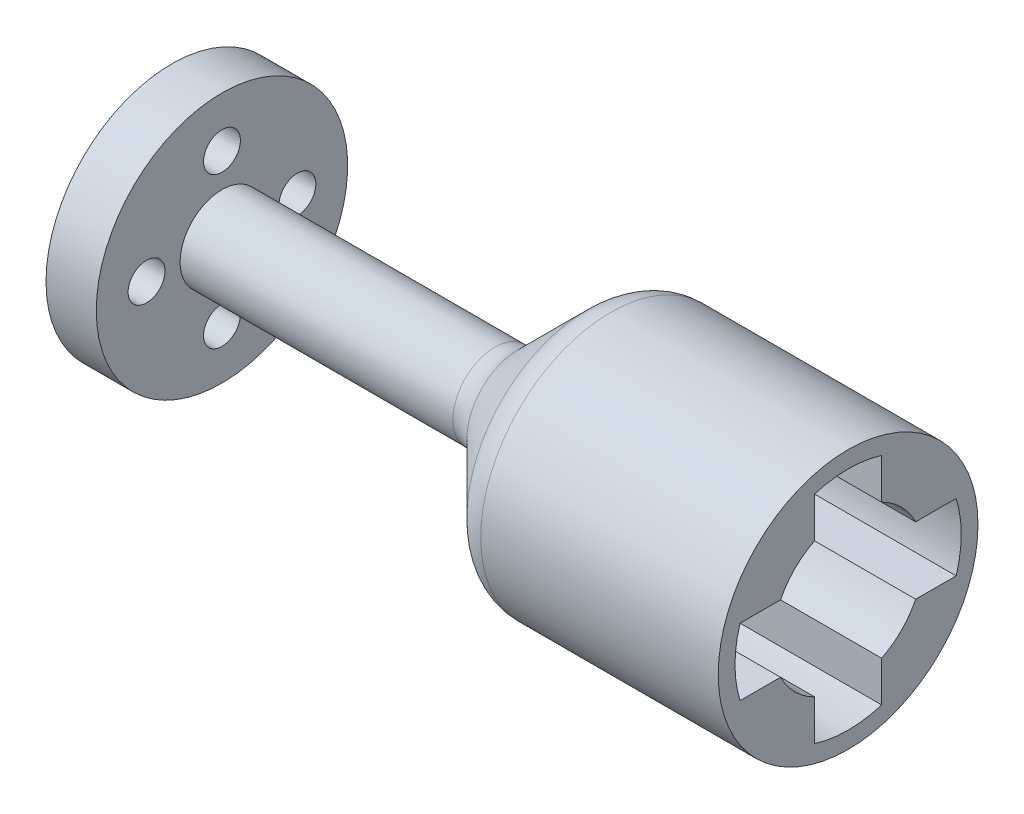
ISO-10303-21;
HEADER;
FILE_DESCRIPTION(('STEP AP214'),'2;1');
FILE_NAME('part.step','',(''),(''),'','','');
FILE_SCHEMA(('AUTOMOTIVE_DESIGN { 1 0 10303 214 1 1 1 1 }'));
ENDSEC;
DATA;
#1=APPLICATION_CONTEXT('core data for automotive mechanical design processes');
#2=APPLICATION_PROTOCOL_DEFINITION('international standard','automotive_design',2000,#1);
#3=PRODUCT_CONTEXT('',#1,'mechanical');
#4=PRODUCT('Part','Part','',(#3));
#5=PRODUCT_RELATED_PRODUCT_CATEGORY('part','',(#4));
#6=PRODUCT_DEFINITION_FORMATION('','',#4);
#7=PRODUCT_DEFINITION_CONTEXT('part definition',#1,'design');
#8=PRODUCT_DEFINITION('design','',#6,#7);
#9=PRODUCT_DEFINITION_SHAPE('','',#8);
#10=(LENGTH_UNIT() NAMED_UNIT(*) SI_UNIT(.MILLI.,.METRE.));
#11=(NAMED_UNIT(*) PLANE_ANGLE_UNIT() SI_UNIT($,.RADIAN.));
#12=(NAMED_UNIT(*) SI_UNIT($,.STERADIAN.) SOLID_ANGLE_UNIT());
#13=UNCERTAINTY_MEASURE_WITH_UNIT(LENGTH_MEASURE(1.E-05),#10,'distance_accuracy_value','');
#14=(GEOMETRIC_REPRESENTATION_CONTEXT(3) GLOBAL_UNCERTAINTY_ASSIGNED_CONTEXT((#13)) GLOBAL_UNIT_ASSIGNED_CONTEXT((#10,
#11,#12)) REPRESENTATION_CONTEXT('',''));
#15=CARTESIAN_POINT('',(0.,0.,0.));
#16=DIRECTION('',(0.,0.,1.));
#17=DIRECTION('',(1.,0.,0.));
#18=AXIS2_PLACEMENT_3D('',#15,#16,#17);
#19=CARTESIAN_POINT('',(-11.8461774132376,0.,2.));
#20=DIRECTION('',(0.,0.,1.));
#21=DIRECTION('',(1.,0.,0.));
#22=AXIS2_PLACEMENT_3D('',#19,#20,#21);
#23=PLANE('',#22);
#24=DIRECTION('',(-1.,0.,0.));
#25=VECTOR('',#24,1.);
#26=CARTESIAN_POINT('',(11.,4.03112887414927,2.));
#27=LINE('',#26,#25);
#28=CARTESIAN_POINT('',(-2.,4.03112887414927,2.));
#29=VERTEX_POINT('',#28);
#30=CARTESIAN_POINT('',(11.,4.03112887414927,2.));
#31=VERTEX_POINT('',#30);
#32=EDGE_CURVE('E317',#29,#31,#27,.F.);
#33=ORIENTED_EDGE('',*,*,#32,.F.);
#34=DIRECTION('',(0.,1.,0.));
#35=VECTOR('',#34,1.);
#36=CARTESIAN_POINT('',(-2.,0.,2.));
#37=LINE('',#36,#35);
#38=CARTESIAN_POINT('',(-2.,6.44689847911381,2.));
#39=VERTEX_POINT('',#38);
#40=EDGE_CURVE('E243',#29,#39,#37,.T.);
#41=ORIENTED_EDGE('',*,*,#40,.T.);
#42=DIRECTION('',(1.,0.,0.));
#43=VECTOR('',#42,1.);
#44=CARTESIAN_POINT('',(-11.8461774132376,6.44689847911381,2.));
#45=LINE('',#44,#43);
#46=CARTESIAN_POINT('',(11.,6.44689847911381,2.));
#47=VERTEX_POINT('',#46);
#48=EDGE_CURVE('E246',#39,#47,#45,.T.);
#49=ORIENTED_EDGE('',*,*,#48,.T.);
#50=DIRECTION('',(0.,-1.,0.));
#51=VECTOR('',#50,1.);
#52=CARTESIAN_POINT('',(11.,0.,2.));
#53=LINE('',#52,#51);
#54=EDGE_CURVE('E254',#47,#31,#53,.T.);
#55=ORIENTED_EDGE('',*,*,#54,.T.);
#56=EDGE_LOOP('',(#33,#41,#49,#55));
#57=FACE_BOUND('',#56,.T.);
#58=ADVANCED_FACE('F37',(#57),#23,.F.);
#59=CARTESIAN_POINT('',(-11.8461774132376,0.,-2.));
#60=DIRECTION('',(0.,0.,-1.));
#61=DIRECTION('',(-1.,0.,0.));
#62=AXIS2_PLACEMENT_3D('',#59,#60,#61);
#63=PLANE('',#62);
#64=DIRECTION('',(-1.,0.,0.));
#65=VECTOR('',#64,1.);
#66=CARTESIAN_POINT('',(11.,4.03112887414927,-2.));
#67=LINE('',#66,#65);
#68=CARTESIAN_POINT('',(11.,4.03112887414927,-2.));
#69=VERTEX_POINT('',#68);
#70=CARTESIAN_POINT('',(-2.,4.03112887414927,-2.));
#71=VERTEX_POINT('',#70);
#72=EDGE_CURVE('E322',#69,#71,#67,.T.);
#73=ORIENTED_EDGE('',*,*,#72,.F.);
#74=DIRECTION('',(0.,1.,0.));
#75=VECTOR('',#74,1.);
#76=CARTESIAN_POINT('',(11.,0.,-2.));
#77=LINE('',#76,#75);
#78=CARTESIAN_POINT('',(11.,6.44689847911381,-2.));
#79=VERTEX_POINT('',#78);
#80=EDGE_CURVE('E252',#69,#79,#77,.T.);
#81=ORIENTED_EDGE('',*,*,#80,.T.);
#82=DIRECTION('',(1.,0.,0.));
#83=VECTOR('',#82,1.);
#84=CARTESIAN_POINT('',(-11.8461774132376,6.44689847911381,-2.));
#85=LINE('',#84,#83);
#86=CARTESIAN_POINT('',(-2.,6.44689847911381,-2.));
#87=VERTEX_POINT('',#86);
#88=EDGE_CURVE('E244',#87,#79,#85,.T.);
#89=ORIENTED_EDGE('',*,*,#88,.F.);
#90=DIRECTION('',(0.,-1.,0.));
#91=VECTOR('',#90,1.);
#92=CARTESIAN_POINT('',(-2.,0.,-2.));
#93=LINE('',#92,#91);
#94=EDGE_CURVE('E249',#87,#71,#93,.T.);
#95=ORIENTED_EDGE('',*,*,#94,.T.);
#96=EDGE_LOOP('',(#73,#81,#89,#95));
#97=FACE_BOUND('',#96,.T.);
#98=ADVANCED_FACE('F169',(#97),#63,.F.);
#99=CARTESIAN_POINT('',(-11.8461774132376,2.,0.));
#100=DIRECTION('',(0.,1.,0.));
#101=DIRECTION('',(0.,0.,1.));
#102=AXIS2_PLACEMENT_3D('',#99,#100,#101);
#103=PLANE('',#102);
#104=DIRECTION('',(-1.,0.,0.));
#105=VECTOR('',#104,1.);
#106=CARTESIAN_POINT('',(11.,2.00000000000001,4.03112887414927));
#107=LINE('',#106,#105);
#108=CARTESIAN_POINT('',(11.,2.00000000000001,4.03112887414927));
#109=VERTEX_POINT('',#108);
#110=CARTESIAN_POINT('',(-2.,2.00000000000001,4.03112887414927));
#111=VERTEX_POINT('',#110);
#112=EDGE_CURVE('E324',#109,#111,#107,.T.);
#113=ORIENTED_EDGE('',*,*,#112,.F.);
#114=DIRECTION('',(0.,0.,1.));
#115=VECTOR('',#114,1.);
#116=CARTESIAN_POINT('',(11.,2.,0.));
#117=LINE('',#116,#115);
#118=CARTESIAN_POINT('',(11.,2.00000000000007,6.44689847911379));
#119=VERTEX_POINT('',#118);
#120=EDGE_CURVE('E276',#109,#119,#117,.T.);
#121=ORIENTED_EDGE('',*,*,#120,.T.);
#122=DIRECTION('',(1.,0.,0.));
#123=VECTOR('',#122,1.);
#124=CARTESIAN_POINT('',(-11.8461774132377,2.00000000000007,6.44689847911379));
#125=LINE('',#124,#123);
#126=CARTESIAN_POINT('',(-2.,2.00000000000007,6.44689847911379));
#127=VERTEX_POINT('',#126);
#128=EDGE_CURVE('E305',#127,#119,#125,.T.);
#129=ORIENTED_EDGE('',*,*,#128,.F.);
#130=DIRECTION('',(0.,0.,-1.));
#131=VECTOR('',#130,1.);
#132=CARTESIAN_POINT('',(-2.,2.,0.));
#133=LINE('',#132,#131);
#134=EDGE_CURVE('E257',#127,#111,#133,.T.);
#135=ORIENTED_EDGE('',*,*,#134,.T.);
#136=EDGE_LOOP('',(#113,#121,#129,#135));
#137=FACE_BOUND('',#136,.T.);
#138=ADVANCED_FACE('F175',(#137),#103,.F.);
#139=DIRECTION('',(-1.,0.,0.));
#140=VECTOR('',#139,1.);
#141=CARTESIAN_POINT('',(11.,1.99999999999999,-4.03112887414928));
#142=LINE('',#141,#140);
#143=CARTESIAN_POINT('',(-2.,1.99999999999999,-4.03112887414928));
#144=VERTEX_POINT('',#143);
#145=CARTESIAN_POINT('',(11.,1.99999999999999,-4.03112887414928));
#146=VERTEX_POINT('',#145);
#147=EDGE_CURVE('E326',#144,#146,#142,.F.);
#148=ORIENTED_EDGE('',*,*,#147,.F.);
#149=CARTESIAN_POINT('',(-2.,1.99999999999998,-6.44689847911382));
#150=VERTEX_POINT('',#149);
#151=EDGE_CURVE('E279',#144,#150,#133,.T.);
#152=ORIENTED_EDGE('',*,*,#151,.T.);
#153=DIRECTION('',(1.,0.,0.));
#154=VECTOR('',#153,1.);
#155=CARTESIAN_POINT('',(-11.8461774132376,1.99999999999998,-6.44689847911382));
#156=LINE('',#155,#154);
#157=CARTESIAN_POINT('',(11.,1.99999999999998,-6.44689847911382));
#158=VERTEX_POINT('',#157);
#159=EDGE_CURVE('E265',#150,#158,#156,.T.);
#160=ORIENTED_EDGE('',*,*,#159,.T.);
#161=EDGE_CURVE('E273',#158,#146,#117,.T.);
#162=ORIENTED_EDGE('',*,*,#161,.T.);
#163=EDGE_LOOP('',(#148,#152,#160,#162));
#164=FACE_BOUND('',#163,.T.);
#165=ADVANCED_FACE('F437',(#164),#103,.F.);
#166=CARTESIAN_POINT('',(-11.8461774132376,-2.,0.));
#167=DIRECTION('',(0.,-1.,0.));
#168=DIRECTION('',(0.,0.,-1.));
#169=AXIS2_PLACEMENT_3D('',#166,#167,#168);
#170=PLANE('',#169);
#171=DIRECTION('',(-1.,0.,0.));
#172=VECTOR('',#171,1.);
#173=CARTESIAN_POINT('',(11.,-2.00000000000001,-4.03112887414927));
#174=LINE('',#173,#172);
#175=CARTESIAN_POINT('',(11.,-2.00000000000001,-4.03112887414927));
#176=VERTEX_POINT('',#175);
#177=CARTESIAN_POINT('',(-2.,-2.00000000000001,-4.03112887414927));
#178=VERTEX_POINT('',#177);
#179=EDGE_CURVE('E328',#176,#178,#174,.T.);
#180=ORIENTED_EDGE('',*,*,#179,.F.);
#181=DIRECTION('',(0.,0.,-1.));
#182=VECTOR('',#181,1.);
#183=CARTESIAN_POINT('',(11.,-2.,0.));
#184=LINE('',#183,#182);
#185=CARTESIAN_POINT('',(11.,-2.00000000000002,-6.44689847911381));
#186=VERTEX_POINT('',#185);
#187=EDGE_CURVE('E271',#176,#186,#184,.T.);
#188=ORIENTED_EDGE('',*,*,#187,.T.);
#189=DIRECTION('',(1.,0.,0.));
#190=VECTOR('',#189,1.);
#191=CARTESIAN_POINT('',(-11.8461774132376,-2.00000000000002,-6.44689847911381));
#192=LINE('',#191,#190);
#193=CARTESIAN_POINT('',(-2.,-2.00000000000002,-6.44689847911381));
#194=VERTEX_POINT('',#193);
#195=EDGE_CURVE('E262',#194,#186,#192,.T.);
#196=ORIENTED_EDGE('',*,*,#195,.F.);
#197=DIRECTION('',(0.,0.,1.));
#198=VECTOR('',#197,1.);
#199=CARTESIAN_POINT('',(-2.,-2.,0.));
#200=LINE('',#199,#198);
#201=EDGE_CURVE('E268',#194,#178,#200,.T.);
#202=ORIENTED_EDGE('',*,*,#201,.T.);
#203=EDGE_LOOP('',(#180,#188,#196,#202));
#204=FACE_BOUND('',#203,.T.);
#205=ADVANCED_FACE('F429',(#204),#170,.F.);
#206=CARTESIAN_POINT('',(-11.8461774132376,0.,-2.));
#207=DIRECTION('',(0.,0.,-1.));
#208=DIRECTION('',(-1.,0.,0.));
#209=AXIS2_PLACEMENT_3D('',#206,#207,#208);
#210=PLANE('',#209);
#211=DIRECTION('',(-1.,0.,0.));
#212=VECTOR('',#211,1.);
#213=CARTESIAN_POINT('',(11.,-4.03112887414927,-2.));
#214=LINE('',#213,#212);
#215=CARTESIAN_POINT('',(-2.,-4.03112887414927,-2.));
#216=VERTEX_POINT('',#215);
#217=CARTESIAN_POINT('',(11.,-4.03112887414927,-2.));
#218=VERTEX_POINT('',#217);
#219=EDGE_CURVE('E330',#216,#218,#214,.F.);
#220=ORIENTED_EDGE('',*,*,#219,.F.);
#221=DIRECTION('',(0.,-1.,0.));
#222=VECTOR('',#221,1.);
#223=CARTESIAN_POINT('',(-2.,0.,-2.));
#224=LINE('',#223,#222);
#225=CARTESIAN_POINT('',(-2.,-6.44689847911381,-2.));
#226=VERTEX_POINT('',#225);
#227=EDGE_CURVE('E299',#216,#226,#224,.T.);
#228=ORIENTED_EDGE('',*,*,#227,.T.);
#229=DIRECTION('',(1.,0.,0.));
#230=VECTOR('',#229,1.);
#231=CARTESIAN_POINT('',(-11.8461774132376,-6.44689847911381,-2.));
#232=LINE('',#231,#230);
#233=CARTESIAN_POINT('',(11.,-6.44689847911381,-2.));
#234=VERTEX_POINT('',#233);
#235=EDGE_CURVE('E287',#226,#234,#232,.T.);
#236=ORIENTED_EDGE('',*,*,#235,.T.);
#237=DIRECTION('',(0.,1.,0.));
#238=VECTOR('',#237,1.);
#239=CARTESIAN_POINT('',(11.,0.,-2.));
#240=LINE('',#239,#238);
#241=EDGE_CURVE('E295',#234,#218,#240,.T.);
#242=ORIENTED_EDGE('',*,*,#241,.T.);
#243=EDGE_LOOP('',(#220,#228,#236,#242));
#244=FACE_BOUND('',#243,.T.);
#245=ADVANCED_FACE('F425',(#244),#210,.F.);
#246=CARTESIAN_POINT('',(-11.8461774132376,0.,2.));
#247=DIRECTION('',(0.,0.,1.));
#248=DIRECTION('',(1.,0.,0.));
#249=AXIS2_PLACEMENT_3D('',#246,#247,#248);
#250=PLANE('',#249);
#251=DIRECTION('',(-1.,0.,0.));
#252=VECTOR('',#251,1.);
#253=CARTESIAN_POINT('',(11.,-4.03112887414927,2.));
#254=LINE('',#253,#252);
#255=CARTESIAN_POINT('',(11.,-4.03112887414927,2.));
#256=VERTEX_POINT('',#255);
#257=CARTESIAN_POINT('',(-2.,-4.03112887414927,2.));
#258=VERTEX_POINT('',#257);
#259=EDGE_CURVE('E332',#256,#258,#254,.T.);
#260=ORIENTED_EDGE('',*,*,#259,.F.);
#261=DIRECTION('',(0.,-1.,0.));
#262=VECTOR('',#261,1.);
#263=CARTESIAN_POINT('',(11.,0.,2.));
#264=LINE('',#263,#262);
#265=CARTESIAN_POINT('',(11.,-6.44689847911381,2.));
#266=VERTEX_POINT('',#265);
#267=EDGE_CURVE('E293',#256,#266,#264,.T.);
#268=ORIENTED_EDGE('',*,*,#267,.T.);
#269=DIRECTION('',(1.,0.,0.));
#270=VECTOR('',#269,1.);
#271=CARTESIAN_POINT('',(-11.8461774132376,-6.44689847911381,2.));
#272=LINE('',#271,#270);
#273=CARTESIAN_POINT('',(-2.,-6.44689847911381,2.));
#274=VERTEX_POINT('',#273);
#275=EDGE_CURVE('E284',#274,#266,#272,.T.);
#276=ORIENTED_EDGE('',*,*,#275,.F.);
#277=DIRECTION('',(0.,1.,0.));
#278=VECTOR('',#277,1.);
#279=CARTESIAN_POINT('',(-2.,0.,2.));
#280=LINE('',#279,#278);
#281=EDGE_CURVE('E290',#274,#258,#280,.T.);
#282=ORIENTED_EDGE('',*,*,#281,.T.);
#283=EDGE_LOOP('',(#260,#268,#276,#282));
#284=FACE_BOUND('',#283,.T.);
#285=ADVANCED_FACE('F417',(#284),#250,.F.);
#286=CARTESIAN_POINT('',(-11.8461774132377,-2.,0.));
#287=DIRECTION('',(0.,-1.,0.));
#288=DIRECTION('',(0.,0.,-1.));
#289=AXIS2_PLACEMENT_3D('',#286,#287,#288);
#290=PLANE('',#289);
#291=DIRECTION('',(-1.,0.,0.));
#292=VECTOR('',#291,1.);
#293=CARTESIAN_POINT('',(11.,-1.99999999999996,4.03112887414929));
#294=LINE('',#293,#292);
#295=CARTESIAN_POINT('',(-2.,-1.99999999999996,4.0311288741493));
#296=VERTEX_POINT('',#295);
#297=CARTESIAN_POINT('',(11.,-1.99999999999996,4.0311288741493));
#298=VERTEX_POINT('',#297);
#299=EDGE_CURVE('E227',#296,#298,#294,.F.);
#300=ORIENTED_EDGE('',*,*,#299,.F.);
#301=DIRECTION('',(0.,0.,1.));
#302=VECTOR('',#301,1.);
#303=CARTESIAN_POINT('',(-2.,-2.,0.));
#304=LINE('',#303,#302);
#305=CARTESIAN_POINT('',(-2.,-1.99999999999993,6.44689847911383));
#306=VERTEX_POINT('',#305);
#307=EDGE_CURVE('E298',#296,#306,#304,.T.);
#308=ORIENTED_EDGE('',*,*,#307,.T.);
#309=DIRECTION('',(1.,0.,0.));
#310=VECTOR('',#309,1.);
#311=CARTESIAN_POINT('',(-11.8461774132377,-1.99999999999993,6.44689847911383));
#312=LINE('',#311,#310);
#313=CARTESIAN_POINT('',(11.,-1.99999999999993,6.44689847911383));
#314=VERTEX_POINT('',#313);
#315=EDGE_CURVE('E308',#306,#314,#312,.T.);
#316=ORIENTED_EDGE('',*,*,#315,.T.);
#317=DIRECTION('',(0.,0.,-1.));
#318=VECTOR('',#317,1.);
#319=CARTESIAN_POINT('',(11.,-2.,0.));
#320=LINE('',#319,#318);
#321=EDGE_CURVE('E314',#314,#298,#320,.T.);
#322=ORIENTED_EDGE('',*,*,#321,.T.);
#323=EDGE_LOOP('',(#300,#308,#316,#322));
#324=FACE_BOUND('',#323,.T.);
#325=ADVANCED_FACE('F208',(#324),#290,.F.);
#326=CARTESIAN_POINT('',(-4.,0.,0.));
#327=DIRECTION('',(1.,0.,0.));
#328=DIRECTION('',(0.,0.,-1.));
#329=AXIS2_PLACEMENT_3D('',#326,#327,#328);
#330=CONICAL_SURFACE('',#329,7.75,0.78539816339745);
#331=CARTESIAN_POINT('',(-4.58578643762691,0.,0.));
#332=DIRECTION('',(-1.,0.,0.));
#333=DIRECTION('',(0.,0.,1.));
#334=AXIS2_PLACEMENT_3D('',#331,#332,#333);
#335=CIRCLE('',#334,7.16421356237309);
#336=CARTESIAN_POINT('',(-4.58578643762691,0.,7.16421356237309));
#337=VERTEX_POINT('',#336);
#338=EDGE_CURVE('E223',#337,#337,#335,.T.);
#339=ORIENTED_EDGE('',*,*,#338,.T.);
#340=EDGE_LOOP('',(#339));
#341=FACE_BOUND('',#340,.T.);
#342=CARTESIAN_POINT('',(-8.66421356237307,0.,0.));
#343=DIRECTION('',(1.,0.,0.));
#344=DIRECTION('',(0.,0.,-1.));
#345=AXIS2_PLACEMENT_3D('',#342,#343,#344);
#346=CIRCLE('',#345,3.08578643762691);
#347=CARTESIAN_POINT('',(-8.66421356237307,0.,-3.08578643762691));
#348=VERTEX_POINT('',#347);
#349=EDGE_CURVE('E224',#348,#348,#346,.T.);
#350=ORIENTED_EDGE('',*,*,#349,.T.);
#351=EDGE_LOOP('',(#350));
#352=FACE_BOUND('',#351,.T.);
#353=ADVANCED_FACE('F205',(#341,#352),#330,.T.);
#354=CARTESIAN_POINT('',(0.,0.,0.));
#355=DIRECTION('',(-1.,0.,0.));
#356=DIRECTION('',(0.,0.,1.));
#357=AXIS2_PLACEMENT_3D('',#354,#355,#356);
#358=CYLINDRICAL_SURFACE('',#357,7.75);
#359=CARTESIAN_POINT('',(-3.17157287525381,0.,0.));
#360=DIRECTION('',(1.,0.,0.));
#361=DIRECTION('',(0.,0.,-1.));
#362=AXIS2_PLACEMENT_3D('',#359,#360,#361);
#363=CIRCLE('',#362,7.75);
#364=CARTESIAN_POINT('',(-3.17157287525381,0.,-7.75));
#365=VERTEX_POINT('',#364);
#366=EDGE_CURVE('E45',#365,#365,#363,.T.);
#367=ORIENTED_EDGE('',*,*,#366,.T.);
#368=EDGE_LOOP('',(#367));
#369=FACE_BOUND('',#368,.T.);
#370=CARTESIAN_POINT('',(11.,0.,0.));
#371=DIRECTION('',(-1.,0.,0.));
#372=DIRECTION('',(0.,0.,1.));
#373=AXIS2_PLACEMENT_3D('',#370,#371,#372);
#374=CIRCLE('',#373,7.75);
#375=CARTESIAN_POINT('',(11.,0.,7.75));
#376=VERTEX_POINT('',#375);
#377=EDGE_CURVE('E231',#376,#376,#374,.T.);
#378=ORIENTED_EDGE('',*,*,#377,.T.);
#379=EDGE_LOOP('',(#378));
#380=FACE_BOUND('',#379,.T.);
#381=ADVANCED_FACE('F201',(#369,#380),#358,.T.);
#382=CARTESIAN_POINT('',(11.,7.75,0.));
#383=DIRECTION('',(-1.,0.,0.));
#384=DIRECTION('',(0.,0.,1.));
#385=AXIS2_PLACEMENT_3D('',#382,#383,#384);
#386=PLANE('',#385);
#387=CARTESIAN_POINT('',(11.,0.,0.));
#388=DIRECTION('',(1.,0.,0.));
#389=DIRECTION('',(0.,0.,-1.));
#390=AXIS2_PLACEMENT_3D('',#387,#388,#389);
#391=CIRCLE('',#390,4.5);
#392=EDGE_CURVE('E679',#298,#256,#391,.T.);
#393=ORIENTED_EDGE('',*,*,#392,.F.);
#394=ORIENTED_EDGE('',*,*,#321,.F.);
#395=CARTESIAN_POINT('',(11.,0.,0.));
#396=DIRECTION('',(1.,0.,0.));
#397=DIRECTION('',(0.,1.,0.));
#398=AXIS2_PLACEMENT_3D('',#395,#396,#397);
#399=CIRCLE('',#398,6.75);
#400=EDGE_CURVE('E309',#119,#314,#399,.T.);
#401=ORIENTED_EDGE('',*,*,#400,.F.);
#402=ORIENTED_EDGE('',*,*,#120,.F.);
#403=EDGE_CURVE('E341',#31,#109,#391,.T.);
#404=ORIENTED_EDGE('',*,*,#403,.F.);
#405=ORIENTED_EDGE('',*,*,#54,.F.);
#406=CARTESIAN_POINT('',(11.,0.,0.));
#407=DIRECTION('',(1.,0.,0.));
#408=DIRECTION('',(0.,0.,-1.));
#409=AXIS2_PLACEMENT_3D('',#406,#407,#408);
#410=CIRCLE('',#409,6.75);
#411=EDGE_CURVE('E247',#79,#47,#410,.T.);
#412=ORIENTED_EDGE('',*,*,#411,.F.);
#413=ORIENTED_EDGE('',*,*,#80,.F.);
#414=EDGE_CURVE('E334',#146,#69,#391,.T.);
#415=ORIENTED_EDGE('',*,*,#414,.F.);
#416=ORIENTED_EDGE('',*,*,#161,.F.);
#417=CARTESIAN_POINT('',(11.,0.,0.));
#418=DIRECTION('',(1.,0.,0.));
#419=DIRECTION('',(0.,-1.,0.));
#420=AXIS2_PLACEMENT_3D('',#417,#418,#419);
#421=CIRCLE('',#420,6.75);
#422=EDGE_CURVE('E266',#186,#158,#421,.T.);
#423=ORIENTED_EDGE('',*,*,#422,.F.);
#424=ORIENTED_EDGE('',*,*,#187,.F.);
#425=EDGE_CURVE('E338',#218,#176,#391,.T.);
#426=ORIENTED_EDGE('',*,*,#425,.F.);
#427=ORIENTED_EDGE('',*,*,#241,.F.);
#428=CARTESIAN_POINT('',(11.,0.,0.));
#429=DIRECTION('',(1.,0.,0.));
#430=DIRECTION('',(0.,0.,1.));
#431=AXIS2_PLACEMENT_3D('',#428,#429,#430);
#432=CIRCLE('',#431,6.75);
#433=EDGE_CURVE('E288',#266,#234,#432,.T.);
#434=ORIENTED_EDGE('',*,*,#433,.F.);
#435=ORIENTED_EDGE('',*,*,#267,.F.);
#436=EDGE_LOOP('',(#393,#394,#401,#402,#404,#405,#412,#413,#415,#416,#423,#424,#426,#427,#434,#435));
#437=FACE_BOUND('',#436,.T.);
#438=ORIENTED_EDGE('',*,*,#377,.F.);
#439=EDGE_LOOP('',(#438));
#440=FACE_BOUND('',#439,.T.);
#441=ADVANCED_FACE('F197',(#437,#440),#386,.F.);
#442=CARTESIAN_POINT('',(-29.3598232801109,7.5,0.));
#443=DIRECTION('',(1.,0.,0.));
#444=DIRECTION('',(0.,0.,-1.));
#445=AXIS2_PLACEMENT_3D('',#442,#443,#444);
#446=PLANE('',#445);
#447=CARTESIAN_POINT('',(-29.3598232801109,0.,0.));
#448=DIRECTION('',(1.,0.,0.));
#449=DIRECTION('',(0.,0.,-1.));
#450=AXIS2_PLACEMENT_3D('',#447,#448,#449);
#451=CIRCLE('',#450,1.1);
#452=CARTESIAN_POINT('',(-29.3598232801109,0.,-1.1));
#453=VERTEX_POINT('',#452);
#454=EDGE_CURVE('E369',#453,#453,#451,.T.);
#455=ORIENTED_EDGE('',*,*,#454,.T.);
#456=EDGE_LOOP('',(#455));
#457=FACE_BOUND('',#456,.T.);
#458=CARTESIAN_POINT('',(-29.3598232801109,4.5,0.));
#459=DIRECTION('',(-1.,0.,0.));
#460=DIRECTION('',(0.,0.,1.));
#461=AXIS2_PLACEMENT_3D('',#458,#459,#460);
#462=CIRCLE('',#461,1.1);
#463=CARTESIAN_POINT('',(-29.3598232801109,4.5,1.1));
#464=VERTEX_POINT('',#463);
#465=EDGE_CURVE('E361',#464,#464,#462,.T.);
#466=ORIENTED_EDGE('',*,*,#465,.F.);
#467=EDGE_LOOP('',(#466));
#468=FACE_BOUND('',#467,.T.);
#469=CARTESIAN_POINT('',(-29.3598232801109,0.,4.5));
#470=DIRECTION('',(-1.,0.,0.));
#471=DIRECTION('',(0.,0.,1.));
#472=AXIS2_PLACEMENT_3D('',#469,#470,#471);
#473=CIRCLE('',#472,1.1);
#474=CARTESIAN_POINT('',(-29.3598232801109,0.,5.6));
#475=VERTEX_POINT('',#474);
#476=EDGE_CURVE('E355',#475,#475,#473,.T.);
#477=ORIENTED_EDGE('',*,*,#476,.F.);
#478=EDGE_LOOP('',(#477));
#479=FACE_BOUND('',#478,.T.);
#480=CARTESIAN_POINT('',(-29.3598232801109,-4.5,0.));
#481=DIRECTION('',(-1.,0.,0.));
#482=DIRECTION('',(0.,0.,1.));
#483=AXIS2_PLACEMENT_3D('',#480,#481,#482);
#484=CIRCLE('',#483,1.1);
#485=CARTESIAN_POINT('',(-29.3598232801109,-4.5,1.1));
#486=VERTEX_POINT('',#485);
#487=EDGE_CURVE('E349',#486,#486,#484,.T.);
#488=ORIENTED_EDGE('',*,*,#487,.F.);
#489=EDGE_LOOP('',(#488));
#490=FACE_BOUND('',#489,.T.);
#491=CARTESIAN_POINT('',(-29.3598232801109,0.,-4.5));
#492=DIRECTION('',(-1.,0.,0.));
#493=DIRECTION('',(0.,0.,1.));
#494=AXIS2_PLACEMENT_3D('',#491,#492,#493);
#495=CIRCLE('',#494,1.1);
#496=CARTESIAN_POINT('',(-29.3598232801109,0.,-3.4));
#497=VERTEX_POINT('',#496);
#498=EDGE_CURVE('E342',#497,#497,#495,.T.);
#499=ORIENTED_EDGE('',*,*,#498,.F.);
#500=EDGE_LOOP('',(#499));
#501=FACE_BOUND('',#500,.T.);
#502=CARTESIAN_POINT('',(-29.3598232801109,0.,0.));
#503=DIRECTION('',(-1.,0.,0.));
#504=DIRECTION('',(0.,0.,1.));
#505=AXIS2_PLACEMENT_3D('',#502,#503,#504);
#506=CIRCLE('',#505,7.5);
#507=CARTESIAN_POINT('',(-29.3598232801109,0.,7.5));
#508=VERTEX_POINT('',#507);
#509=EDGE_CURVE('E234',#508,#508,#506,.T.);
#510=ORIENTED_EDGE('',*,*,#509,.T.);
#511=EDGE_LOOP('',(#510));
#512=FACE_BOUND('',#511,.T.);
#513=ADVANCED_FACE('F193',(#457,#468,#479,#490,#501,#512),#446,.F.);
#514=CARTESIAN_POINT('',(0.,0.,0.));
#515=DIRECTION('',(-1.,0.,0.));
#516=DIRECTION('',(0.,0.,1.));
#517=AXIS2_PLACEMENT_3D('',#514,#515,#516);
#518=CYLINDRICAL_SURFACE('',#517,7.5);
#519=ORIENTED_EDGE('',*,*,#509,.F.);
#520=EDGE_LOOP('',(#519));
#521=FACE_BOUND('',#520,.T.);
#522=CARTESIAN_POINT('',(-26.3598232801109,0.,0.));
#523=DIRECTION('',(-1.,0.,0.));
#524=DIRECTION('',(0.,0.,1.));
#525=AXIS2_PLACEMENT_3D('',#522,#523,#524);
#526=CIRCLE('',#525,7.5);
#527=CARTESIAN_POINT('',(-26.3598232801109,0.,7.5));
#528=VERTEX_POINT('',#527);
#529=EDGE_CURVE('E237',#528,#528,#526,.T.);
#530=ORIENTED_EDGE('',*,*,#529,.T.);
#531=EDGE_LOOP('',(#530));
#532=FACE_BOUND('',#531,.T.);
#533=ADVANCED_FACE('F189',(#521,#532),#518,.T.);
#534=CARTESIAN_POINT('',(-26.3598232801109,7.5,0.));
#535=DIRECTION('',(-1.,0.,0.));
#536=DIRECTION('',(0.,0.,1.));
#537=AXIS2_PLACEMENT_3D('',#534,#535,#536);
#538=PLANE('',#537);
#539=CARTESIAN_POINT('',(-26.3598232801109,4.5,0.));
#540=DIRECTION('',(-1.,0.,0.));
#541=DIRECTION('',(0.,0.,1.));
#542=AXIS2_PLACEMENT_3D('',#539,#540,#541);
#543=CIRCLE('',#542,1.1);
#544=CARTESIAN_POINT('',(-26.3598232801109,4.5,1.1));
#545=VERTEX_POINT('',#544);
#546=EDGE_CURVE('E364',#545,#545,#543,.F.);
#547=ORIENTED_EDGE('',*,*,#546,.F.);
#548=EDGE_LOOP('',(#547));
#549=FACE_BOUND('',#548,.T.);
#550=CARTESIAN_POINT('',(-26.3598232801109,0.,4.5));
#551=DIRECTION('',(-1.,0.,0.));
#552=DIRECTION('',(0.,0.,1.));
#553=AXIS2_PLACEMENT_3D('',#550,#551,#552);
#554=CIRCLE('',#553,1.1);
#555=CARTESIAN_POINT('',(-26.3598232801109,0.,5.6));
#556=VERTEX_POINT('',#555);
#557=EDGE_CURVE('E358',#556,#556,#554,.F.);
#558=ORIENTED_EDGE('',*,*,#557,.F.);
#559=EDGE_LOOP('',(#558));
#560=FACE_BOUND('',#559,.T.);
#561=CARTESIAN_POINT('',(-26.3598232801109,-4.5,0.));
#562=DIRECTION('',(-1.,0.,0.));
#563=DIRECTION('',(0.,0.,1.));
#564=AXIS2_PLACEMENT_3D('',#561,#562,#563);
#565=CIRCLE('',#564,1.1);
#566=CARTESIAN_POINT('',(-26.3598232801109,-4.5,1.1));
#567=VERTEX_POINT('',#566);
#568=EDGE_CURVE('E352',#567,#567,#565,.F.);
#569=ORIENTED_EDGE('',*,*,#568,.F.);
#570=EDGE_LOOP('',(#569));
#571=FACE_BOUND('',#570,.T.);
#572=CARTESIAN_POINT('',(-26.3598232801109,0.,-4.5));
#573=DIRECTION('',(-1.,0.,0.));
#574=DIRECTION('',(0.,0.,1.));
#575=AXIS2_PLACEMENT_3D('',#572,#573,#574);
#576=CIRCLE('',#575,1.1);
#577=CARTESIAN_POINT('',(-26.3598232801109,0.,-3.4));
#578=VERTEX_POINT('',#577);
#579=EDGE_CURVE('E345',#578,#578,#576,.F.);
#580=ORIENTED_EDGE('',*,*,#579,.F.);
#581=EDGE_LOOP('',(#580));
#582=FACE_BOUND('',#581,.T.);
#583=ORIENTED_EDGE('',*,*,#529,.F.);
#584=EDGE_LOOP('',(#583));
#585=FACE_BOUND('',#584,.T.);
#586=CARTESIAN_POINT('',(-26.3598232801109,0.,0.));
#587=DIRECTION('',(-1.,0.,0.));
#588=DIRECTION('',(0.,0.,1.));
#589=AXIS2_PLACEMENT_3D('',#586,#587,#588);
#590=CIRCLE('',#589,2.5);
#591=CARTESIAN_POINT('',(-26.3598232801109,0.,2.5));
#592=VERTEX_POINT('',#591);
#593=EDGE_CURVE('E240',#592,#592,#590,.T.);
#594=ORIENTED_EDGE('',*,*,#593,.T.);
#595=EDGE_LOOP('',(#594));
#596=FACE_BOUND('',#595,.T.);
#597=ADVANCED_FACE('F185',(#549,#560,#571,#582,#585,#596),#538,.F.);
#598=CARTESIAN_POINT('',(0.,0.,0.));
#599=DIRECTION('',(-1.,0.,0.));
#600=DIRECTION('',(0.,0.,1.));
#601=AXIS2_PLACEMENT_3D('',#598,#599,#600);
#602=CYLINDRICAL_SURFACE('',#601,2.5);
#603=CARTESIAN_POINT('',(-10.0784271247462,0.,0.));
#604=DIRECTION('',(-1.,0.,0.));
#605=DIRECTION('',(0.,0.,1.));
#606=AXIS2_PLACEMENT_3D('',#603,#604,#605);
#607=CIRCLE('',#606,2.5);
#608=CARTESIAN_POINT('',(-10.0784271247462,0.,2.5));
#609=VERTEX_POINT('',#608);
#610=EDGE_CURVE('E12',#609,#609,#607,.T.);
#611=ORIENTED_EDGE('',*,*,#610,.T.);
#612=EDGE_LOOP('',(#611));
#613=FACE_BOUND('',#612,.T.);
#614=ORIENTED_EDGE('',*,*,#593,.F.);
#615=EDGE_LOOP('',(#614));
#616=FACE_BOUND('',#615,.T.);
#617=ADVANCED_FACE('F181',(#613,#616),#602,.T.);
#618=CARTESIAN_POINT('',(-11.8461774132376,0.,0.));
#619=DIRECTION('',(1.,0.,0.));
#620=DIRECTION('',(0.,0.,-1.));
#621=AXIS2_PLACEMENT_3D('',#618,#619,#620);
#622=CYLINDRICAL_SURFACE('',#621,6.75);
#623=CARTESIAN_POINT('',(-2.,0.,0.));
#624=DIRECTION('',(1.,0.,0.));
#625=DIRECTION('',(0.,0.,-1.));
#626=AXIS2_PLACEMENT_3D('',#623,#624,#625);
#627=CIRCLE('',#626,6.75);
#628=EDGE_CURVE('E61',#39,#87,#627,.F.);
#629=ORIENTED_EDGE('',*,*,#628,.T.);
#630=ORIENTED_EDGE('',*,*,#88,.T.);
#631=ORIENTED_EDGE('',*,*,#411,.T.);
#632=ORIENTED_EDGE('',*,*,#48,.F.);
#633=EDGE_LOOP('',(#629,#630,#631,#632));
#634=FACE_BOUND('',#633,.T.);
#635=ADVANCED_FACE('F184',(#634),#622,.F.);
#636=CARTESIAN_POINT('',(-2.,0.,0.));
#637=DIRECTION('',(1.,0.,0.));
#638=DIRECTION('',(0.,0.,-1.));
#639=AXIS2_PLACEMENT_3D('',#636,#637,#638);
#640=PLANE('',#639);
#641=ORIENTED_EDGE('',*,*,#40,.F.);
#642=CARTESIAN_POINT('',(-2.,0.,0.));
#643=DIRECTION('',(1.,0.,0.));
#644=DIRECTION('',(0.,0.,-1.));
#645=AXIS2_PLACEMENT_3D('',#642,#643,#644);
#646=CIRCLE('',#645,4.5);
#647=EDGE_CURVE('E52',#29,#111,#646,.T.);
#648=ORIENTED_EDGE('',*,*,#647,.T.);
#649=ORIENTED_EDGE('',*,*,#134,.F.);
#650=CARTESIAN_POINT('',(-2.,0.,0.));
#651=DIRECTION('',(1.,0.,0.));
#652=DIRECTION('',(0.,0.,-1.));
#653=AXIS2_PLACEMENT_3D('',#650,#651,#652);
#654=CIRCLE('',#653,6.75);
#655=EDGE_CURVE('E311',#306,#127,#654,.F.);
#656=ORIENTED_EDGE('',*,*,#655,.F.);
#657=ORIENTED_EDGE('',*,*,#307,.F.);
#658=EDGE_CURVE('E694',#296,#258,#646,.T.);
#659=ORIENTED_EDGE('',*,*,#658,.T.);
#660=ORIENTED_EDGE('',*,*,#281,.F.);
#661=CARTESIAN_POINT('',(-2.,0.,0.));
#662=DIRECTION('',(1.,0.,0.));
#663=DIRECTION('',(0.,0.,-1.));
#664=AXIS2_PLACEMENT_3D('',#661,#662,#663);
#665=CIRCLE('',#664,6.75);
#666=EDGE_CURVE('E301',#226,#274,#665,.F.);
#667=ORIENTED_EDGE('',*,*,#666,.F.);
#668=ORIENTED_EDGE('',*,*,#227,.F.);
#669=EDGE_CURVE('E339',#216,#178,#646,.T.);
#670=ORIENTED_EDGE('',*,*,#669,.T.);
#671=ORIENTED_EDGE('',*,*,#201,.F.);
#672=CARTESIAN_POINT('',(-2.,0.,0.));
#673=DIRECTION('',(1.,0.,0.));
#674=DIRECTION('',(0.,0.,-1.));
#675=AXIS2_PLACEMENT_3D('',#672,#673,#674);
#676=CIRCLE('',#675,6.75);
#677=EDGE_CURVE('E280',#150,#194,#676,.F.);
#678=ORIENTED_EDGE('',*,*,#677,.F.);
#679=ORIENTED_EDGE('',*,*,#151,.F.);
#680=EDGE_CURVE('E335',#144,#71,#646,.T.);
#681=ORIENTED_EDGE('',*,*,#680,.T.);
#682=ORIENTED_EDGE('',*,*,#94,.F.);
#683=ORIENTED_EDGE('',*,*,#628,.F.);
#684=EDGE_LOOP('',(#641,#648,#649,#656,#657,#659,#660,#667,#668,#670,#671,#678,#679,#681,#682,#683));
#685=FACE_BOUND('',#684,.T.);
#686=ADVANCED_FACE('F433',(#685),#640,.T.);
#687=CARTESIAN_POINT('',(-11.8461774132376,0.,0.));
#688=DIRECTION('',(1.,0.,0.));
#689=DIRECTION('',(0.,0.,-1.));
#690=AXIS2_PLACEMENT_3D('',#687,#688,#689);
#691=CYLINDRICAL_SURFACE('',#690,6.75);
#692=ORIENTED_EDGE('',*,*,#677,.T.);
#693=ORIENTED_EDGE('',*,*,#195,.T.);
#694=ORIENTED_EDGE('',*,*,#422,.T.);
#695=ORIENTED_EDGE('',*,*,#159,.F.);
#696=EDGE_LOOP('',(#692,#693,#694,#695));
#697=FACE_BOUND('',#696,.T.);
#698=ADVANCED_FACE('F421',(#697),#691,.F.);
#699=CARTESIAN_POINT('',(-11.8461774132376,0.,0.));
#700=DIRECTION('',(1.,0.,0.));
#701=DIRECTION('',(0.,0.,-1.));
#702=AXIS2_PLACEMENT_3D('',#699,#700,#701);
#703=CYLINDRICAL_SURFACE('',#702,6.75);
#704=ORIENTED_EDGE('',*,*,#666,.T.);
#705=ORIENTED_EDGE('',*,*,#275,.T.);
#706=ORIENTED_EDGE('',*,*,#433,.T.);
#707=ORIENTED_EDGE('',*,*,#235,.F.);
#708=EDGE_LOOP('',(#704,#705,#706,#707));
#709=FACE_BOUND('',#708,.T.);
#710=ADVANCED_FACE('F413',(#709),#703,.F.);
#711=CARTESIAN_POINT('',(-11.8461774132377,0.,0.));
#712=DIRECTION('',(1.,0.,0.));
#713=DIRECTION('',(0.,0.,-1.));
#714=AXIS2_PLACEMENT_3D('',#711,#712,#713);
#715=CYLINDRICAL_SURFACE('',#714,6.75);
#716=ORIENTED_EDGE('',*,*,#655,.T.);
#717=ORIENTED_EDGE('',*,*,#128,.T.);
#718=ORIENTED_EDGE('',*,*,#400,.T.);
#719=ORIENTED_EDGE('',*,*,#315,.F.);
#720=EDGE_LOOP('',(#716,#717,#718,#719));
#721=FACE_BOUND('',#720,.T.);
#722=ADVANCED_FACE('F410',(#721),#715,.F.);
#723=CARTESIAN_POINT('',(11.,0.,0.));
#724=DIRECTION('',(-1.,0.,0.));
#725=DIRECTION('',(0.,0.,1.));
#726=AXIS2_PLACEMENT_3D('',#723,#724,#725);
#727=CYLINDRICAL_SURFACE('',#726,4.5);
#728=ORIENTED_EDGE('',*,*,#259,.T.);
#729=ORIENTED_EDGE('',*,*,#658,.F.);
#730=ORIENTED_EDGE('',*,*,#299,.T.);
#731=ORIENTED_EDGE('',*,*,#392,.T.);
#732=EDGE_LOOP('',(#728,#729,#730,#731));
#733=FACE_BOUND('',#732,.T.);
#734=ADVANCED_FACE('F407',(#733),#727,.F.);
#735=ORIENTED_EDGE('',*,*,#179,.T.);
#736=ORIENTED_EDGE('',*,*,#669,.F.);
#737=ORIENTED_EDGE('',*,*,#219,.T.);
#738=ORIENTED_EDGE('',*,*,#425,.T.);
#739=EDGE_LOOP('',(#735,#736,#737,#738));
#740=FACE_BOUND('',#739,.T.);
#741=ADVANCED_FACE('F472',(#740),#727,.F.);
#742=ORIENTED_EDGE('',*,*,#72,.T.);
#743=ORIENTED_EDGE('',*,*,#680,.F.);
#744=ORIENTED_EDGE('',*,*,#147,.T.);
#745=ORIENTED_EDGE('',*,*,#414,.T.);
#746=EDGE_LOOP('',(#742,#743,#744,#745));
#747=FACE_BOUND('',#746,.T.);
#748=ADVANCED_FACE('F404',(#747),#727,.F.);
#749=ORIENTED_EDGE('',*,*,#32,.T.);
#750=ORIENTED_EDGE('',*,*,#403,.T.);
#751=ORIENTED_EDGE('',*,*,#112,.T.);
#752=ORIENTED_EDGE('',*,*,#647,.F.);
#753=EDGE_LOOP('',(#749,#750,#751,#752));
#754=FACE_BOUND('',#753,.T.);
#755=ADVANCED_FACE('F394',(#754),#727,.F.);
#756=CARTESIAN_POINT('',(11.001,0.,-4.5));
#757=DIRECTION('',(-1.,0.,0.));
#758=DIRECTION('',(0.,0.,1.));
#759=AXIS2_PLACEMENT_3D('',#756,#757,#758);
#760=CYLINDRICAL_SURFACE('',#759,1.1);
#761=ORIENTED_EDGE('',*,*,#498,.T.);
#762=EDGE_LOOP('',(#761));
#763=FACE_BOUND('',#762,.T.);
#764=ORIENTED_EDGE('',*,*,#579,.T.);
#765=EDGE_LOOP('',(#764));
#766=FACE_BOUND('',#765,.T.);
#767=ADVANCED_FACE('F390',(#763,#766),#760,.F.);
#768=CARTESIAN_POINT('',(11.001,-4.5,0.));
#769=DIRECTION('',(-1.,0.,0.));
#770=DIRECTION('',(0.,0.,1.));
#771=AXIS2_PLACEMENT_3D('',#768,#769,#770);
#772=CYLINDRICAL_SURFACE('',#771,1.1);
#773=ORIENTED_EDGE('',*,*,#487,.T.);
#774=EDGE_LOOP('',(#773));
#775=FACE_BOUND('',#774,.T.);
#776=ORIENTED_EDGE('',*,*,#568,.T.);
#777=EDGE_LOOP('',(#776));
#778=FACE_BOUND('',#777,.T.);
#779=ADVANCED_FACE('F393',(#775,#778),#772,.F.);
#780=CARTESIAN_POINT('',(11.001,0.,4.5));
#781=DIRECTION('',(-1.,0.,0.));
#782=DIRECTION('',(0.,0.,1.));
#783=AXIS2_PLACEMENT_3D('',#780,#781,#782);
#784=CYLINDRICAL_SURFACE('',#783,1.1);
#785=ORIENTED_EDGE('',*,*,#476,.T.);
#786=EDGE_LOOP('',(#785));
#787=FACE_BOUND('',#786,.T.);
#788=ORIENTED_EDGE('',*,*,#557,.T.);
#789=EDGE_LOOP('',(#788));
#790=FACE_BOUND('',#789,.T.);
#791=ADVANCED_FACE('F216',(#787,#790),#784,.F.);
#792=CARTESIAN_POINT('',(11.001,4.5,0.));
#793=DIRECTION('',(-1.,0.,0.));
#794=DIRECTION('',(0.,0.,1.));
#795=AXIS2_PLACEMENT_3D('',#792,#793,#794);
#796=CYLINDRICAL_SURFACE('',#795,1.1);
#797=ORIENTED_EDGE('',*,*,#465,.T.);
#798=EDGE_LOOP('',(#797));
#799=FACE_BOUND('',#798,.T.);
#800=ORIENTED_EDGE('',*,*,#546,.T.);
#801=EDGE_LOOP('',(#800));
#802=FACE_BOUND('',#801,.T.);
#803=ADVANCED_FACE('F211',(#799,#802),#796,.F.);
#804=CARTESIAN_POINT('',(-3.17157287525381,0.,0.));
#805=DIRECTION('',(1.,0.,0.));
#806=DIRECTION('',(0.,0.,-1.));
#807=AXIS2_PLACEMENT_3D('',#804,#805,#806);
#808=TOROIDAL_SURFACE('',#807,5.75,2.);
#809=ORIENTED_EDGE('',*,*,#366,.F.);
#810=EDGE_LOOP('',(#809));
#811=FACE_BOUND('',#810,.T.);
#812=ORIENTED_EDGE('',*,*,#338,.F.);
#813=EDGE_LOOP('',(#812));
#814=FACE_BOUND('',#813,.T.);
#815=ADVANCED_FACE('F164',(#811,#814),#808,.T.);
#816=CARTESIAN_POINT('',(-10.0784271247462,0.,0.));
#817=DIRECTION('',(-1.,0.,0.));
#818=DIRECTION('',(0.,0.,1.));
#819=AXIS2_PLACEMENT_3D('',#816,#817,#818);
#820=TOROIDAL_SURFACE('',#819,4.5,2.);
#821=ORIENTED_EDGE('',*,*,#349,.F.);
#822=EDGE_LOOP('',(#821));
#823=FACE_BOUND('',#822,.T.);
#824=ORIENTED_EDGE('',*,*,#610,.F.);
#825=EDGE_LOOP('',(#824));
#826=FACE_BOUND('',#825,.T.);
#827=ADVANCED_FACE('F39',(#823,#826),#820,.F.);
#828=CARTESIAN_POINT('',(-24.2598232801109,0.,0.));
#829=DIRECTION('',(-1.,0.,0.));
#830=DIRECTION('',(0.,0.,1.));
#831=AXIS2_PLACEMENT_3D('',#828,#829,#830);
#832=CONICAL_SURFACE('',#831,0.,0.78539816339745);
#833=CARTESIAN_POINT('',(-25.3598232801109,0.,0.));
#834=DIRECTION('',(1.,0.,0.));
#835=DIRECTION('',(0.,0.,-1.));
#836=AXIS2_PLACEMENT_3D('',#833,#834,#835);
#837=CIRCLE('',#836,1.1);
#838=CARTESIAN_POINT('',(-25.3598232801109,0.,-1.1));
#839=VERTEX_POINT('',#838);
#840=EDGE_CURVE('E346',#839,#839,#837,.T.);
#841=ORIENTED_EDGE('',*,*,#840,.F.);
#842=EDGE_LOOP('',(#841));
#843=FACE_BOUND('',#842,.T.);
#844=CARTESIAN_POINT('',(-24.2598232801109,0.,0.));
#845=VERTEX_POINT('',#844);
#846=VERTEX_LOOP('',#845);
#847=FACE_BOUND('',#846,.T.);
#848=ADVANCED_FACE('F153',(#843,#847),#832,.F.);
#849=CARTESIAN_POINT('',(-29.3598232801109,0.,0.));
#850=DIRECTION('',(1.,0.,0.));
#851=DIRECTION('',(0.,0.,-1.));
#852=AXIS2_PLACEMENT_3D('',#849,#850,#851);
#853=CYLINDRICAL_SURFACE('',#852,1.1);
#854=ORIENTED_EDGE('',*,*,#454,.F.);
#855=EDGE_LOOP('',(#854));
#856=FACE_BOUND('',#855,.T.);
#857=ORIENTED_EDGE('',*,*,#840,.T.);
#858=EDGE_LOOP('',(#857));
#859=FACE_BOUND('',#858,.T.);
#860=ADVANCED_FACE('F155',(#856,#859),#853,.F.);
#861=CLOSED_SHELL('',(#58,#98,#138,#165,#205,#245,#285,#325,#353,#381,#441,#513,#533,#597,#617,
#635,#686,#698,#710,#722,#734,#741,#748,#755,#767,#779,#791,#803,#815,#827,#848,#860));
#862=MANIFOLD_SOLID_BREP('B2',#861);
#863=ADVANCED_BREP_SHAPE_REPRESENTATION('',(#18,#862),#14);
#864=SHAPE_DEFINITION_REPRESENTATION(#9,#863);
ENDSEC;
END-ISO-10303-21;
